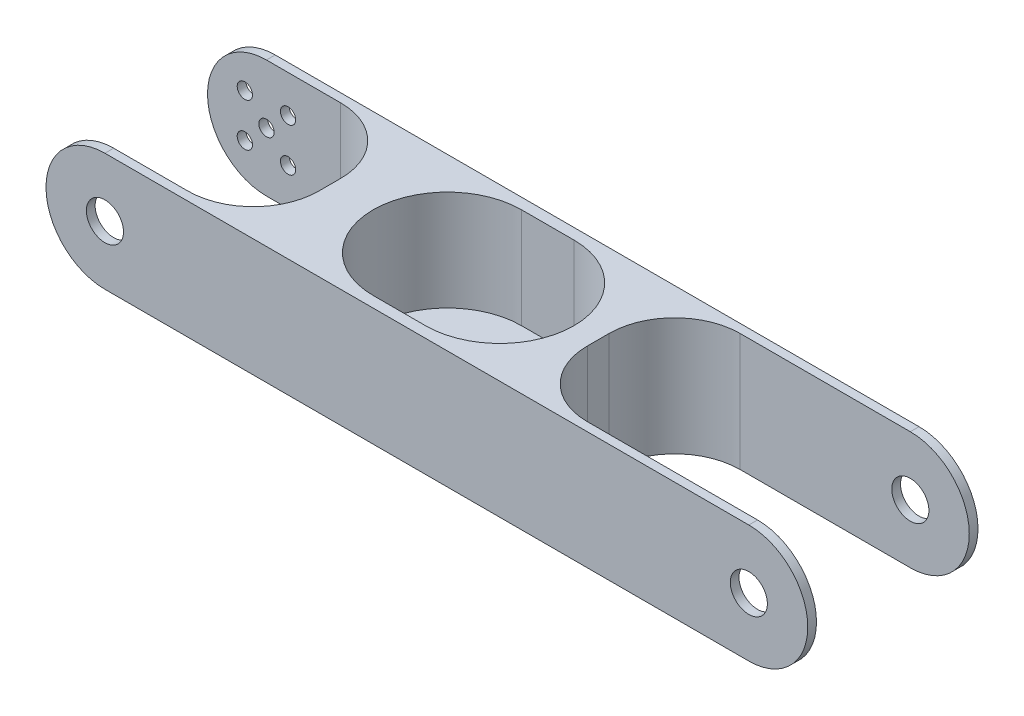
ISO-10303-21;
HEADER;
FILE_DESCRIPTION(('STEP AP214'),'2;1');
FILE_NAME('part.step','',(''),(''),'','','');
FILE_SCHEMA(('AUTOMOTIVE_DESIGN { 1 0 10303 214 1 1 1 1 }'));
ENDSEC;
DATA;
#1=APPLICATION_CONTEXT('core data for automotive mechanical design processes');
#2=APPLICATION_PROTOCOL_DEFINITION('international standard','automotive_design',2000,#1);
#3=PRODUCT_CONTEXT('',#1,'mechanical');
#4=PRODUCT('Part','Part','',(#3));
#5=PRODUCT_RELATED_PRODUCT_CATEGORY('part','',(#4));
#6=PRODUCT_DEFINITION_FORMATION('','',#4);
#7=PRODUCT_DEFINITION_CONTEXT('part definition',#1,'design');
#8=PRODUCT_DEFINITION('design','',#6,#7);
#9=PRODUCT_DEFINITION_SHAPE('','',#8);
#10=(LENGTH_UNIT() NAMED_UNIT(*) SI_UNIT(.MILLI.,.METRE.));
#11=(NAMED_UNIT(*) PLANE_ANGLE_UNIT() SI_UNIT($,.RADIAN.));
#12=(NAMED_UNIT(*) SI_UNIT($,.STERADIAN.) SOLID_ANGLE_UNIT());
#13=UNCERTAINTY_MEASURE_WITH_UNIT(LENGTH_MEASURE(1.E-05),#10,'distance_accuracy_value','');
#14=(GEOMETRIC_REPRESENTATION_CONTEXT(3) GLOBAL_UNCERTAINTY_ASSIGNED_CONTEXT((#13)) GLOBAL_UNIT_ASSIGNED_CONTEXT((#10,
#11,#12)) REPRESENTATION_CONTEXT('',''));
#15=CARTESIAN_POINT('',(0.,0.,0.));
#16=DIRECTION('',(0.,0.,1.));
#17=DIRECTION('',(1.,0.,0.));
#18=AXIS2_PLACEMENT_3D('',#15,#16,#17);
#19=CARTESIAN_POINT('',(147.5,0.,39.));
#20=DIRECTION('',(0.,0.,-1.));
#21=DIRECTION('',(-1.,0.,0.));
#22=AXIS2_PLACEMENT_3D('',#19,#20,#21);
#23=CYLINDRICAL_SURFACE('',#22,13.5);
#24=DIRECTION('',(0.,0.,-1.));
#25=VECTOR('',#24,1.);
#26=CARTESIAN_POINT('',(147.5,13.5,39.));
#27=LINE('',#26,#25);
#28=CARTESIAN_POINT('',(147.5,13.5,2.));
#29=VERTEX_POINT('',#28);
#30=CARTESIAN_POINT('',(147.5,13.5,0.));
#31=VERTEX_POINT('',#30);
#32=EDGE_CURVE('E439',#29,#31,#27,.T.);
#33=ORIENTED_EDGE('',*,*,#32,.F.);
#34=CARTESIAN_POINT('',(147.5,0.,2.));
#35=DIRECTION('',(0.,0.,-1.));
#36=DIRECTION('',(-1.,0.,0.));
#37=AXIS2_PLACEMENT_3D('',#34,#35,#36);
#38=CIRCLE('',#37,13.5);
#39=CARTESIAN_POINT('',(147.5,-13.5,2.));
#40=VERTEX_POINT('',#39);
#41=EDGE_CURVE('E337',#29,#40,#38,.T.);
#42=ORIENTED_EDGE('',*,*,#41,.T.);
#43=DIRECTION('',(0.,0.,-1.));
#44=VECTOR('',#43,1.);
#45=CARTESIAN_POINT('',(147.5,-13.5,39.));
#46=LINE('',#45,#44);
#47=CARTESIAN_POINT('',(147.5,-13.5,0.));
#48=VERTEX_POINT('',#47);
#49=EDGE_CURVE('E444',#40,#48,#46,.T.);
#50=ORIENTED_EDGE('',*,*,#49,.T.);
#51=CARTESIAN_POINT('',(147.5,0.,0.));
#52=DIRECTION('',(0.,0.,1.));
#53=DIRECTION('',(1.,0.,0.));
#54=AXIS2_PLACEMENT_3D('',#51,#52,#53);
#55=CIRCLE('',#54,13.5);
#56=EDGE_CURVE('E428',#48,#31,#55,.T.);
#57=ORIENTED_EDGE('',*,*,#56,.T.);
#58=EDGE_LOOP('',(#33,#42,#50,#57));
#59=FACE_BOUND('',#58,.T.);
#60=ADVANCED_FACE('F44',(#59),#23,.T.);
#61=CARTESIAN_POINT('',(147.5,0.,0.));
#62=DIRECTION('',(0.,0.,1.));
#63=DIRECTION('',(1.,0.,0.));
#64=AXIS2_PLACEMENT_3D('',#61,#62,#63);
#65=CYLINDRICAL_SURFACE('',#64,4.25000000000001);
#66=CARTESIAN_POINT('',(147.5,0.,2.));
#67=DIRECTION('',(0.,0.,-1.));
#68=DIRECTION('',(-1.,0.,0.));
#69=AXIS2_PLACEMENT_3D('',#66,#67,#68);
#70=CIRCLE('',#69,4.25000000000001);
#71=CARTESIAN_POINT('',(143.25,0.,2.));
#72=VERTEX_POINT('',#71);
#73=EDGE_CURVE('E336',#72,#72,#70,.F.);
#74=ORIENTED_EDGE('',*,*,#73,.T.);
#75=EDGE_LOOP('',(#74));
#76=FACE_BOUND('',#75,.T.);
#77=CARTESIAN_POINT('',(147.5,0.,0.));
#78=DIRECTION('',(0.,0.,1.));
#79=DIRECTION('',(1.,0.,0.));
#80=AXIS2_PLACEMENT_3D('',#77,#78,#79);
#81=CIRCLE('',#80,4.25000000000001);
#82=CARTESIAN_POINT('',(151.75,0.,0.));
#83=VERTEX_POINT('',#82);
#84=EDGE_CURVE('E398',#83,#83,#81,.T.);
#85=ORIENTED_EDGE('',*,*,#84,.F.);
#86=EDGE_LOOP('',(#85));
#87=FACE_BOUND('',#86,.T.);
#88=ADVANCED_FACE('F618',(#76,#87),#65,.F.);
#89=CARTESIAN_POINT('',(0.,0.,39.));
#90=DIRECTION('',(0.,0.,-1.));
#91=DIRECTION('',(-1.,0.,0.));
#92=AXIS2_PLACEMENT_3D('',#89,#90,#91);
#93=CYLINDRICAL_SURFACE('',#92,13.5);
#94=DIRECTION('',(0.,0.,-1.));
#95=VECTOR('',#94,1.);
#96=CARTESIAN_POINT('',(0.,-13.5,39.));
#97=LINE('',#96,#95);
#98=CARTESIAN_POINT('',(0.,-13.5,2.));
#99=VERTEX_POINT('',#98);
#100=CARTESIAN_POINT('',(0.,-13.5,0.));
#101=VERTEX_POINT('',#100);
#102=EDGE_CURVE('E449',#99,#101,#97,.T.);
#103=ORIENTED_EDGE('',*,*,#102,.F.);
#104=CARTESIAN_POINT('',(0.,0.,2.));
#105=DIRECTION('',(0.,0.,-1.));
#106=DIRECTION('',(-1.,0.,0.));
#107=AXIS2_PLACEMENT_3D('',#104,#105,#106);
#108=CIRCLE('',#107,13.5);
#109=CARTESIAN_POINT('',(0.,13.5,2.));
#110=VERTEX_POINT('',#109);
#111=EDGE_CURVE('E393',#99,#110,#108,.T.);
#112=ORIENTED_EDGE('',*,*,#111,.T.);
#113=DIRECTION('',(0.,0.,-1.));
#114=VECTOR('',#113,1.);
#115=CARTESIAN_POINT('',(0.,13.5,39.));
#116=LINE('',#115,#114);
#117=CARTESIAN_POINT('',(0.,13.5,0.));
#118=VERTEX_POINT('',#117);
#119=EDGE_CURVE('E420',#110,#118,#116,.T.);
#120=ORIENTED_EDGE('',*,*,#119,.T.);
#121=CARTESIAN_POINT('',(0.,0.,0.));
#122=DIRECTION('',(0.,0.,1.));
#123=DIRECTION('',(1.,0.,0.));
#124=AXIS2_PLACEMENT_3D('',#121,#122,#123);
#125=CIRCLE('',#124,13.5);
#126=EDGE_CURVE('E402',#118,#101,#125,.T.);
#127=ORIENTED_EDGE('',*,*,#126,.T.);
#128=EDGE_LOOP('',(#103,#112,#120,#127));
#129=FACE_BOUND('',#128,.T.);
#130=ADVANCED_FACE('F575',(#129),#93,.T.);
#131=CARTESIAN_POINT('',(0.,13.5,39.));
#132=VERTEX_POINT('',#131);
#133=CARTESIAN_POINT('',(0.,13.5,37.));
#134=VERTEX_POINT('',#133);
#135=EDGE_CURVE('E435',#132,#134,#116,.T.);
#136=ORIENTED_EDGE('',*,*,#135,.T.);
#137=CARTESIAN_POINT('',(0.,0.,37.));
#138=DIRECTION('',(0.,0.,1.));
#139=DIRECTION('',(1.,0.,0.));
#140=AXIS2_PLACEMENT_3D('',#137,#138,#139);
#141=CIRCLE('',#140,13.5);
#142=CARTESIAN_POINT('',(0.,-13.5,37.));
#143=VERTEX_POINT('',#142);
#144=EDGE_CURVE('E380',#134,#143,#141,.T.);
#145=ORIENTED_EDGE('',*,*,#144,.T.);
#146=CARTESIAN_POINT('',(0.,-13.5,39.));
#147=VERTEX_POINT('',#146);
#148=EDGE_CURVE('E450',#147,#143,#97,.T.);
#149=ORIENTED_EDGE('',*,*,#148,.F.);
#150=CARTESIAN_POINT('',(0.,0.,39.));
#151=DIRECTION('',(0.,0.,1.));
#152=DIRECTION('',(1.,0.,0.));
#153=AXIS2_PLACEMENT_3D('',#150,#151,#152);
#154=CIRCLE('',#153,13.5);
#155=EDGE_CURVE('E406',#132,#147,#154,.T.);
#156=ORIENTED_EDGE('',*,*,#155,.F.);
#157=EDGE_LOOP('',(#136,#145,#149,#156));
#158=FACE_BOUND('',#157,.T.);
#159=ADVANCED_FACE('F46',(#158),#93,.T.);
#160=CARTESIAN_POINT('',(0.,-13.5,39.));
#161=DIRECTION('',(0.,1.,0.));
#162=DIRECTION('',(0.,0.,1.));
#163=AXIS2_PLACEMENT_3D('',#160,#161,#162);
#164=PLANE('',#163);
#165=DIRECTION('',(1.,0.,0.));
#166=VECTOR('',#165,1.);
#167=CARTESIAN_POINT('',(62.,-13.5,10.));
#168=LINE('',#167,#166);
#169=CARTESIAN_POINT('',(62.,-13.5,10.));
#170=VERTEX_POINT('',#169);
#171=CARTESIAN_POINT('',(70.,-13.5,10.));
#172=VERTEX_POINT('',#171);
#173=EDGE_CURVE('E218',#170,#172,#168,.T.);
#174=ORIENTED_EDGE('',*,*,#173,.F.);
#175=CARTESIAN_POINT('',(62.,-13.5,19.5));
#176=DIRECTION('',(0.,-1.,0.));
#177=DIRECTION('',(0.,0.,-1.));
#178=AXIS2_PLACEMENT_3D('',#175,#176,#177);
#179=CIRCLE('',#178,9.49999999999999);
#180=CARTESIAN_POINT('',(62.,-13.5,29.));
#181=VERTEX_POINT('',#180);
#182=EDGE_CURVE('E60',#181,#170,#179,.T.);
#183=ORIENTED_EDGE('',*,*,#182,.F.);
#184=DIRECTION('',(-1.,0.,0.));
#185=VECTOR('',#184,1.);
#186=CARTESIAN_POINT('',(62.,-13.5,29.));
#187=LINE('',#186,#185);
#188=CARTESIAN_POINT('',(70.,-13.5,29.));
#189=VERTEX_POINT('',#188);
#190=EDGE_CURVE('E226',#189,#181,#187,.T.);
#191=ORIENTED_EDGE('',*,*,#190,.F.);
#192=CARTESIAN_POINT('',(70.,-13.5,19.5));
#193=DIRECTION('',(0.,-1.,0.));
#194=DIRECTION('',(0.,0.,-1.));
#195=AXIS2_PLACEMENT_3D('',#192,#193,#194);
#196=CIRCLE('',#195,9.49999999999999);
#197=EDGE_CURVE('E208',#172,#189,#196,.T.);
#198=ORIENTED_EDGE('',*,*,#197,.F.);
#199=EDGE_LOOP('',(#174,#183,#191,#198));
#200=FACE_BOUND('',#199,.T.);
#201=ORIENTED_EDGE('',*,*,#49,.F.);
#202=DIRECTION('',(1.,0.,0.));
#203=VECTOR('',#202,1.);
#204=CARTESIAN_POINT('',(108.5,-13.5,2.));
#205=LINE('',#204,#203);
#206=CARTESIAN_POINT('',(108.5,-13.5,2.));
#207=VERTEX_POINT('',#206);
#208=EDGE_CURVE('E286',#207,#40,#205,.T.);
#209=ORIENTED_EDGE('',*,*,#208,.F.);
#210=CARTESIAN_POINT('',(108.5,-13.5,17.));
#211=DIRECTION('',(0.,-1.,0.));
#212=DIRECTION('',(0.,0.,1.));
#213=AXIS2_PLACEMENT_3D('',#210,#211,#212);
#214=CIRCLE('',#213,15.);
#215=CARTESIAN_POINT('',(93.5,-13.5,17.));
#216=VERTEX_POINT('',#215);
#217=EDGE_CURVE('E313',#216,#207,#214,.T.);
#218=ORIENTED_EDGE('',*,*,#217,.F.);
#219=DIRECTION('',(0.,0.,-1.));
#220=VECTOR('',#219,1.);
#221=CARTESIAN_POINT('',(93.5,-13.5,22.));
#222=LINE('',#221,#220);
#223=CARTESIAN_POINT('',(93.5,-13.5,22.));
#224=VERTEX_POINT('',#223);
#225=EDGE_CURVE('E309',#224,#216,#222,.T.);
#226=ORIENTED_EDGE('',*,*,#225,.F.);
#227=CARTESIAN_POINT('',(108.5,-13.5,22.));
#228=DIRECTION('',(0.,-1.,0.));
#229=DIRECTION('',(0.,0.,-1.));
#230=AXIS2_PLACEMENT_3D('',#227,#228,#229);
#231=CIRCLE('',#230,15.);
#232=CARTESIAN_POINT('',(108.5,-13.5,37.));
#233=VERTEX_POINT('',#232);
#234=EDGE_CURVE('E305',#233,#224,#231,.T.);
#235=ORIENTED_EDGE('',*,*,#234,.F.);
#236=DIRECTION('',(-1.,0.,0.));
#237=VECTOR('',#236,1.);
#238=CARTESIAN_POINT('',(108.5,-13.5,37.));
#239=LINE('',#238,#237);
#240=CARTESIAN_POINT('',(147.5,-13.5,37.));
#241=VERTEX_POINT('',#240);
#242=EDGE_CURVE('E280',#241,#233,#239,.T.);
#243=ORIENTED_EDGE('',*,*,#242,.F.);
#244=CARTESIAN_POINT('',(147.5,-13.5,39.));
#245=VERTEX_POINT('',#244);
#246=EDGE_CURVE('E445',#245,#241,#46,.T.);
#247=ORIENTED_EDGE('',*,*,#246,.F.);
#248=DIRECTION('',(1.,0.,0.));
#249=VECTOR('',#248,1.);
#250=CARTESIAN_POINT('',(0.,-13.5,39.));
#251=LINE('',#250,#249);
#252=EDGE_CURVE('E410',#147,#245,#251,.T.);
#253=ORIENTED_EDGE('',*,*,#252,.F.);
#254=ORIENTED_EDGE('',*,*,#148,.T.);
#255=DIRECTION('',(1.,0.,0.));
#256=VECTOR('',#255,1.);
#257=CARTESIAN_POINT('',(-32.,-13.5,37.));
#258=LINE('',#257,#256);
#259=CARTESIAN_POINT('',(17.,-13.5,37.));
#260=VERTEX_POINT('',#259);
#261=EDGE_CURVE('E342',#143,#260,#258,.T.);
#262=ORIENTED_EDGE('',*,*,#261,.T.);
#263=CARTESIAN_POINT('',(17.,-13.5,22.));
#264=DIRECTION('',(0.,1.,0.));
#265=DIRECTION('',(0.,0.,-1.));
#266=AXIS2_PLACEMENT_3D('',#263,#264,#265);
#267=CIRCLE('',#266,15.);
#268=CARTESIAN_POINT('',(32.,-13.5,22.));
#269=VERTEX_POINT('',#268);
#270=EDGE_CURVE('E346',#260,#269,#267,.T.);
#271=ORIENTED_EDGE('',*,*,#270,.T.);
#272=DIRECTION('',(0.,0.,-1.));
#273=VECTOR('',#272,1.);
#274=CARTESIAN_POINT('',(32.,-13.5,22.));
#275=LINE('',#274,#273);
#276=CARTESIAN_POINT('',(32.,-13.5,17.));
#277=VERTEX_POINT('',#276);
#278=EDGE_CURVE('E351',#269,#277,#275,.T.);
#279=ORIENTED_EDGE('',*,*,#278,.T.);
#280=CARTESIAN_POINT('',(17.,-13.5,17.));
#281=DIRECTION('',(0.,1.,0.));
#282=DIRECTION('',(0.,0.,-1.));
#283=AXIS2_PLACEMENT_3D('',#280,#281,#282);
#284=CIRCLE('',#283,15.);
#285=CARTESIAN_POINT('',(17.,-13.5,2.));
#286=VERTEX_POINT('',#285);
#287=EDGE_CURVE('E355',#277,#286,#284,.T.);
#288=ORIENTED_EDGE('',*,*,#287,.T.);
#289=DIRECTION('',(-1.,0.,0.));
#290=VECTOR('',#289,1.);
#291=CARTESIAN_POINT('',(-32.,-13.5,2.));
#292=LINE('',#291,#290);
#293=EDGE_CURVE('E359',#286,#99,#292,.T.);
#294=ORIENTED_EDGE('',*,*,#293,.T.);
#295=ORIENTED_EDGE('',*,*,#102,.T.);
#296=DIRECTION('',(1.,0.,0.));
#297=VECTOR('',#296,1.);
#298=CARTESIAN_POINT('',(0.,-13.5,0.));
#299=LINE('',#298,#297);
#300=EDGE_CURVE('E424',#101,#48,#299,.T.);
#301=ORIENTED_EDGE('',*,*,#300,.T.);
#302=EDGE_LOOP('',(#201,#209,#218,#226,#235,#243,#247,#253,#254,#262,#271,#279,#288,#294,#295,#301));
#303=FACE_BOUND('',#302,.T.);
#304=ADVANCED_FACE('F223',(#200,#303),#164,.F.);
#305=ORIENTED_EDGE('',*,*,#246,.T.);
#306=CARTESIAN_POINT('',(147.5,0.,37.));
#307=DIRECTION('',(0.,0.,1.));
#308=DIRECTION('',(1.,0.,0.));
#309=AXIS2_PLACEMENT_3D('',#306,#307,#308);
#310=CIRCLE('',#309,13.5);
#311=CARTESIAN_POINT('',(147.5,13.5,37.));
#312=VERTEX_POINT('',#311);
#313=EDGE_CURVE('E332',#241,#312,#310,.T.);
#314=ORIENTED_EDGE('',*,*,#313,.T.);
#315=CARTESIAN_POINT('',(147.5,13.5,39.));
#316=VERTEX_POINT('',#315);
#317=EDGE_CURVE('E440',#316,#312,#27,.T.);
#318=ORIENTED_EDGE('',*,*,#317,.F.);
#319=CARTESIAN_POINT('',(147.5,0.,39.));
#320=DIRECTION('',(0.,0.,1.));
#321=DIRECTION('',(1.,0.,0.));
#322=AXIS2_PLACEMENT_3D('',#319,#320,#321);
#323=CIRCLE('',#322,13.5);
#324=EDGE_CURVE('E414',#245,#316,#323,.T.);
#325=ORIENTED_EDGE('',*,*,#324,.F.);
#326=EDGE_LOOP('',(#305,#314,#318,#325));
#327=FACE_BOUND('',#326,.T.);
#328=ADVANCED_FACE('F552',(#327),#23,.T.);
#329=CARTESIAN_POINT('',(0.,13.5,39.));
#330=DIRECTION('',(0.,-1.,0.));
#331=DIRECTION('',(0.,0.,-1.));
#332=AXIS2_PLACEMENT_3D('',#329,#330,#331);
#333=PLANE('',#332);
#334=DIRECTION('',(1.,0.,0.));
#335=VECTOR('',#334,1.);
#336=CARTESIAN_POINT('',(58.9447918531487,13.5,36.5));
#337=LINE('',#336,#335);
#338=CARTESIAN_POINT('',(58.9447918531487,13.5,36.5));
#339=VERTEX_POINT('',#338);
#340=CARTESIAN_POINT('',(70.9447918531488,13.5,36.5));
#341=VERTEX_POINT('',#340);
#342=EDGE_CURVE('E254',#339,#341,#337,.T.);
#343=ORIENTED_EDGE('',*,*,#342,.F.);
#344=CARTESIAN_POINT('',(58.9447918531487,13.5,19.5));
#345=DIRECTION('',(0.,1.,0.));
#346=DIRECTION('',(0.,0.,1.));
#347=AXIS2_PLACEMENT_3D('',#344,#345,#346);
#348=CIRCLE('',#347,17.);
#349=CARTESIAN_POINT('',(58.9447918531487,13.5,2.5));
#350=VERTEX_POINT('',#349);
#351=EDGE_CURVE('E236',#350,#339,#348,.T.);
#352=ORIENTED_EDGE('',*,*,#351,.F.);
#353=DIRECTION('',(-1.,0.,0.));
#354=VECTOR('',#353,1.);
#355=CARTESIAN_POINT('',(58.9447918531487,13.5,2.5));
#356=LINE('',#355,#354);
#357=CARTESIAN_POINT('',(70.9447918531487,13.5,2.5));
#358=VERTEX_POINT('',#357);
#359=EDGE_CURVE('E262',#358,#350,#356,.T.);
#360=ORIENTED_EDGE('',*,*,#359,.F.);
#361=CARTESIAN_POINT('',(70.9447918531487,13.5,19.5));
#362=DIRECTION('',(0.,1.,0.));
#363=DIRECTION('',(0.,0.,1.));
#364=AXIS2_PLACEMENT_3D('',#361,#362,#363);
#365=CIRCLE('',#364,17.);
#366=EDGE_CURVE('E258',#341,#358,#365,.T.);
#367=ORIENTED_EDGE('',*,*,#366,.F.);
#368=EDGE_LOOP('',(#343,#352,#360,#367));
#369=FACE_BOUND('',#368,.T.);
#370=CARTESIAN_POINT('',(108.5,13.5,17.));
#371=DIRECTION('',(0.,-1.,0.));
#372=DIRECTION('',(0.,0.,1.));
#373=AXIS2_PLACEMENT_3D('',#370,#371,#372);
#374=CIRCLE('',#373,15.);
#375=CARTESIAN_POINT('',(93.5,13.5,17.));
#376=VERTEX_POINT('',#375);
#377=CARTESIAN_POINT('',(108.5,13.5,2.));
#378=VERTEX_POINT('',#377);
#379=EDGE_CURVE('E294',#376,#378,#374,.T.);
#380=ORIENTED_EDGE('',*,*,#379,.T.);
#381=DIRECTION('',(1.,0.,0.));
#382=VECTOR('',#381,1.);
#383=CARTESIAN_POINT('',(108.5,13.5,2.));
#384=LINE('',#383,#382);
#385=EDGE_CURVE('E298',#378,#29,#384,.T.);
#386=ORIENTED_EDGE('',*,*,#385,.T.);
#387=ORIENTED_EDGE('',*,*,#32,.T.);
#388=DIRECTION('',(-1.,0.,0.));
#389=VECTOR('',#388,1.);
#390=CARTESIAN_POINT('',(0.,13.5,0.));
#391=LINE('',#390,#389);
#392=EDGE_CURVE('E411',#31,#118,#391,.T.);
#393=ORIENTED_EDGE('',*,*,#392,.T.);
#394=ORIENTED_EDGE('',*,*,#119,.F.);
#395=DIRECTION('',(-1.,0.,0.));
#396=VECTOR('',#395,1.);
#397=CARTESIAN_POINT('',(-32.,13.5,2.));
#398=LINE('',#397,#396);
#399=CARTESIAN_POINT('',(17.,13.5,2.));
#400=VERTEX_POINT('',#399);
#401=EDGE_CURVE('E347',#400,#110,#398,.T.);
#402=ORIENTED_EDGE('',*,*,#401,.F.);
#403=CARTESIAN_POINT('',(17.,13.5,17.));
#404=DIRECTION('',(0.,1.,0.));
#405=DIRECTION('',(0.,0.,-1.));
#406=AXIS2_PLACEMENT_3D('',#403,#404,#405);
#407=CIRCLE('',#406,15.);
#408=CARTESIAN_POINT('',(32.,13.5,17.));
#409=VERTEX_POINT('',#408);
#410=EDGE_CURVE('E371',#409,#400,#407,.T.);
#411=ORIENTED_EDGE('',*,*,#410,.F.);
#412=DIRECTION('',(0.,0.,-1.));
#413=VECTOR('',#412,1.);
#414=CARTESIAN_POINT('',(32.,13.5,22.));
#415=LINE('',#414,#413);
#416=CARTESIAN_POINT('',(32.,13.5,22.));
#417=VERTEX_POINT('',#416);
#418=EDGE_CURVE('E367',#417,#409,#415,.T.);
#419=ORIENTED_EDGE('',*,*,#418,.F.);
#420=CARTESIAN_POINT('',(17.,13.5,22.));
#421=DIRECTION('',(0.,1.,0.));
#422=DIRECTION('',(0.,0.,-1.));
#423=AXIS2_PLACEMENT_3D('',#420,#421,#422);
#424=CIRCLE('',#423,15.);
#425=CARTESIAN_POINT('',(17.,13.5,37.));
#426=VERTEX_POINT('',#425);
#427=EDGE_CURVE('E341',#426,#417,#424,.T.);
#428=ORIENTED_EDGE('',*,*,#427,.F.);
#429=DIRECTION('',(-1.,0.,0.));
#430=VECTOR('',#429,1.);
#431=CARTESIAN_POINT('',(0.,13.5,37.));
#432=LINE('',#431,#430);
#433=EDGE_CURVE('E454',#426,#134,#432,.T.);
#434=ORIENTED_EDGE('',*,*,#433,.T.);
#435=ORIENTED_EDGE('',*,*,#135,.F.);
#436=DIRECTION('',(-1.,0.,0.));
#437=VECTOR('',#436,1.);
#438=CARTESIAN_POINT('',(0.,13.5,39.));
#439=LINE('',#438,#437);
#440=EDGE_CURVE('E417',#316,#132,#439,.T.);
#441=ORIENTED_EDGE('',*,*,#440,.F.);
#442=ORIENTED_EDGE('',*,*,#317,.T.);
#443=DIRECTION('',(-1.,0.,0.));
#444=VECTOR('',#443,1.);
#445=CARTESIAN_POINT('',(108.5,13.5,37.));
#446=LINE('',#445,#444);
#447=CARTESIAN_POINT('',(108.5,13.5,37.));
#448=VERTEX_POINT('',#447);
#449=EDGE_CURVE('E281',#312,#448,#446,.T.);
#450=ORIENTED_EDGE('',*,*,#449,.T.);
#451=CARTESIAN_POINT('',(108.5,13.5,22.));
#452=DIRECTION('',(0.,-1.,0.));
#453=DIRECTION('',(0.,0.,-1.));
#454=AXIS2_PLACEMENT_3D('',#451,#452,#453);
#455=CIRCLE('',#454,15.);
#456=CARTESIAN_POINT('',(93.5,13.5,22.));
#457=VERTEX_POINT('',#456);
#458=EDGE_CURVE('E285',#448,#457,#455,.T.);
#459=ORIENTED_EDGE('',*,*,#458,.T.);
#460=DIRECTION('',(0.,0.,-1.));
#461=VECTOR('',#460,1.);
#462=CARTESIAN_POINT('',(93.5,13.5,22.));
#463=LINE('',#462,#461);
#464=EDGE_CURVE('E290',#457,#376,#463,.T.);
#465=ORIENTED_EDGE('',*,*,#464,.T.);
#466=EDGE_LOOP('',(#380,#386,#387,#393,#394,#402,#411,#419,#428,#434,#435,#441,#442,#450,#459,#465));
#467=FACE_BOUND('',#466,.T.);
#468=ADVANCED_FACE('F536',(#369,#467),#333,.F.);
#469=CARTESIAN_POINT('',(0.,0.,39.));
#470=DIRECTION('',(0.,0.,1.));
#471=DIRECTION('',(1.,0.,0.));
#472=AXIS2_PLACEMENT_3D('',#469,#470,#471);
#473=PLANE('',#472);
#474=CARTESIAN_POINT('',(0.,0.,39.));
#475=DIRECTION('',(0.,0.,1.));
#476=DIRECTION('',(1.,0.,0.));
#477=AXIS2_PLACEMENT_3D('',#474,#475,#476);
#478=CIRCLE('',#477,4.25);
#479=CARTESIAN_POINT('',(4.25,0.,39.));
#480=VERTEX_POINT('',#479);
#481=EDGE_CURVE('E524',#480,#480,#478,.T.);
#482=ORIENTED_EDGE('',*,*,#481,.F.);
#483=EDGE_LOOP('',(#482));
#484=FACE_BOUND('',#483,.T.);
#485=CARTESIAN_POINT('',(147.5,0.,39.));
#486=DIRECTION('',(0.,0.,1.));
#487=DIRECTION('',(1.,0.,0.));
#488=AXIS2_PLACEMENT_3D('',#485,#486,#487);
#489=CIRCLE('',#488,4.25000000000001);
#490=CARTESIAN_POINT('',(151.75,0.,39.));
#491=VERTEX_POINT('',#490);
#492=EDGE_CURVE('E397',#491,#491,#489,.T.);
#493=ORIENTED_EDGE('',*,*,#492,.F.);
#494=EDGE_LOOP('',(#493));
#495=FACE_BOUND('',#494,.T.);
#496=ORIENTED_EDGE('',*,*,#155,.T.);
#497=ORIENTED_EDGE('',*,*,#252,.T.);
#498=ORIENTED_EDGE('',*,*,#324,.T.);
#499=ORIENTED_EDGE('',*,*,#440,.T.);
#500=EDGE_LOOP('',(#496,#497,#498,#499));
#501=FACE_BOUND('',#500,.T.);
#502=ADVANCED_FACE('F532',(#484,#495,#501),#473,.T.);
#503=CARTESIAN_POINT('',(0.,0.,0.));
#504=DIRECTION('',(0.,0.,1.));
#505=DIRECTION('',(1.,0.,0.));
#506=AXIS2_PLACEMENT_3D('',#503,#504,#505);
#507=PLANE('',#506);
#508=CARTESIAN_POINT('',(-4.94974746830583,4.94974746830583,0.));
#509=DIRECTION('',(0.,0.,-1.));
#510=DIRECTION('',(-1.,0.,0.));
#511=AXIS2_PLACEMENT_3D('',#508,#509,#510);
#512=CIRCLE('',#511,1.75);
#513=CARTESIAN_POINT('',(-6.69974746830583,4.94974746830583,0.));
#514=VERTEX_POINT('',#513);
#515=EDGE_CURVE('E493',#514,#514,#512,.T.);
#516=ORIENTED_EDGE('',*,*,#515,.F.);
#517=EDGE_LOOP('',(#516));
#518=FACE_BOUND('',#517,.T.);
#519=CARTESIAN_POINT('',(4.94974746830587,-4.9497474683058,0.));
#520=DIRECTION('',(0.,0.,-1.));
#521=DIRECTION('',(-1.,0.,0.));
#522=AXIS2_PLACEMENT_3D('',#519,#520,#521);
#523=CIRCLE('',#522,1.75);
#524=CARTESIAN_POINT('',(3.19974746830587,-4.9497474683058,0.));
#525=VERTEX_POINT('',#524);
#526=EDGE_CURVE('E494',#525,#525,#523,.T.);
#527=ORIENTED_EDGE('',*,*,#526,.F.);
#528=EDGE_LOOP('',(#527));
#529=FACE_BOUND('',#528,.T.);
#530=CARTESIAN_POINT('',(-4.94974746830582,-4.94974746830585,0.));
#531=DIRECTION('',(0.,0.,-1.));
#532=DIRECTION('',(-1.,0.,0.));
#533=AXIS2_PLACEMENT_3D('',#530,#531,#532);
#534=CIRCLE('',#533,1.75);
#535=CARTESIAN_POINT('',(-6.69974746830582,-4.94974746830585,0.));
#536=VERTEX_POINT('',#535);
#537=EDGE_CURVE('E509',#536,#536,#534,.T.);
#538=ORIENTED_EDGE('',*,*,#537,.F.);
#539=EDGE_LOOP('',(#538));
#540=FACE_BOUND('',#539,.T.);
#541=CARTESIAN_POINT('',(0.,0.,0.));
#542=DIRECTION('',(0.,0.,-1.));
#543=DIRECTION('',(-1.,0.,0.));
#544=AXIS2_PLACEMENT_3D('',#541,#542,#543);
#545=CIRCLE('',#544,1.75);
#546=CARTESIAN_POINT('',(-1.75,0.,0.));
#547=VERTEX_POINT('',#546);
#548=EDGE_CURVE('E510',#547,#547,#545,.T.);
#549=ORIENTED_EDGE('',*,*,#548,.F.);
#550=EDGE_LOOP('',(#549));
#551=FACE_BOUND('',#550,.T.);
#552=CARTESIAN_POINT('',(4.94974746830578,4.94974746830588,0.));
#553=DIRECTION('',(0.,0.,-1.));
#554=DIRECTION('',(-1.,0.,0.));
#555=AXIS2_PLACEMENT_3D('',#552,#553,#554);
#556=CIRCLE('',#555,1.75);
#557=CARTESIAN_POINT('',(3.19974746830578,4.94974746830588,0.));
#558=VERTEX_POINT('',#557);
#559=EDGE_CURVE('E482',#558,#558,#556,.T.);
#560=ORIENTED_EDGE('',*,*,#559,.F.);
#561=EDGE_LOOP('',(#560));
#562=FACE_BOUND('',#561,.T.);
#563=ORIENTED_EDGE('',*,*,#84,.T.);
#564=EDGE_LOOP('',(#563));
#565=FACE_BOUND('',#564,.T.);
#566=ORIENTED_EDGE('',*,*,#126,.F.);
#567=ORIENTED_EDGE('',*,*,#392,.F.);
#568=ORIENTED_EDGE('',*,*,#56,.F.);
#569=ORIENTED_EDGE('',*,*,#300,.F.);
#570=EDGE_LOOP('',(#566,#567,#568,#569));
#571=FACE_BOUND('',#570,.T.);
#572=ADVANCED_FACE('F535',(#518,#529,#540,#551,#562,#565,#571),#507,.F.);
#573=CARTESIAN_POINT('',(147.5,0.,37.));
#574=DIRECTION('',(0.,0.,1.));
#575=DIRECTION('',(1.,0.,0.));
#576=AXIS2_PLACEMENT_3D('',#573,#574,#575);
#577=CIRCLE('',#576,4.25000000000001);
#578=CARTESIAN_POINT('',(151.75,0.,37.));
#579=VERTEX_POINT('',#578);
#580=EDGE_CURVE('E322',#579,#579,#577,.F.);
#581=ORIENTED_EDGE('',*,*,#580,.T.);
#582=EDGE_LOOP('',(#581));
#583=FACE_BOUND('',#582,.T.);
#584=ORIENTED_EDGE('',*,*,#492,.T.);
#585=EDGE_LOOP('',(#584));
#586=FACE_BOUND('',#585,.T.);
#587=ADVANCED_FACE('F625',(#583,#586),#65,.F.);
#588=CARTESIAN_POINT('',(-32.,-13.5,2.));
#589=DIRECTION('',(0.,0.,-1.));
#590=DIRECTION('',(-1.,0.,0.));
#591=AXIS2_PLACEMENT_3D('',#588,#589,#590);
#592=PLANE('',#591);
#593=CARTESIAN_POINT('',(-4.94974746830583,4.94974746830583,2.));
#594=DIRECTION('',(0.,0.,-1.));
#595=DIRECTION('',(-1.,0.,0.));
#596=AXIS2_PLACEMENT_3D('',#593,#594,#595);
#597=CIRCLE('',#596,1.75);
#598=CARTESIAN_POINT('',(-6.69974746830583,4.94974746830583,2.));
#599=VERTEX_POINT('',#598);
#600=EDGE_CURVE('E488',#599,#599,#597,.F.);
#601=ORIENTED_EDGE('',*,*,#600,.F.);
#602=EDGE_LOOP('',(#601));
#603=FACE_BOUND('',#602,.T.);
#604=CARTESIAN_POINT('',(4.94974746830587,-4.9497474683058,2.));
#605=DIRECTION('',(0.,0.,-1.));
#606=DIRECTION('',(-1.,0.,0.));
#607=AXIS2_PLACEMENT_3D('',#604,#605,#606);
#608=CIRCLE('',#607,1.75);
#609=CARTESIAN_POINT('',(3.19974746830587,-4.9497474683058,2.));
#610=VERTEX_POINT('',#609);
#611=EDGE_CURVE('E489',#610,#610,#608,.F.);
#612=ORIENTED_EDGE('',*,*,#611,.F.);
#613=EDGE_LOOP('',(#612));
#614=FACE_BOUND('',#613,.T.);
#615=CARTESIAN_POINT('',(-4.94974746830582,-4.94974746830585,2.));
#616=DIRECTION('',(0.,0.,-1.));
#617=DIRECTION('',(-1.,0.,0.));
#618=AXIS2_PLACEMENT_3D('',#615,#616,#617);
#619=CIRCLE('',#618,1.75);
#620=CARTESIAN_POINT('',(-6.69974746830582,-4.94974746830585,2.));
#621=VERTEX_POINT('',#620);
#622=EDGE_CURVE('E498',#621,#621,#619,.F.);
#623=ORIENTED_EDGE('',*,*,#622,.F.);
#624=EDGE_LOOP('',(#623));
#625=FACE_BOUND('',#624,.T.);
#626=CARTESIAN_POINT('',(0.,0.,2.));
#627=DIRECTION('',(0.,0.,-1.));
#628=DIRECTION('',(-1.,0.,0.));
#629=AXIS2_PLACEMENT_3D('',#626,#627,#628);
#630=CIRCLE('',#629,1.75);
#631=CARTESIAN_POINT('',(-1.75,0.,2.));
#632=VERTEX_POINT('',#631);
#633=EDGE_CURVE('E505',#632,#632,#630,.F.);
#634=ORIENTED_EDGE('',*,*,#633,.F.);
#635=EDGE_LOOP('',(#634));
#636=FACE_BOUND('',#635,.T.);
#637=CARTESIAN_POINT('',(4.94974746830578,4.94974746830588,2.));
#638=DIRECTION('',(0.,0.,-1.));
#639=DIRECTION('',(-1.,0.,0.));
#640=AXIS2_PLACEMENT_3D('',#637,#638,#639);
#641=CIRCLE('',#640,1.75);
#642=CARTESIAN_POINT('',(3.19974746830578,4.94974746830588,2.));
#643=VERTEX_POINT('',#642);
#644=EDGE_CURVE('E479',#643,#643,#641,.F.);
#645=ORIENTED_EDGE('',*,*,#644,.F.);
#646=EDGE_LOOP('',(#645));
#647=FACE_BOUND('',#646,.T.);
#648=ORIENTED_EDGE('',*,*,#293,.F.);
#649=DIRECTION('',(0.,1.,0.));
#650=VECTOR('',#649,1.);
#651=CARTESIAN_POINT('',(17.,-13.5,2.));
#652=LINE('',#651,#650);
#653=EDGE_CURVE('E377',#286,#400,#652,.T.);
#654=ORIENTED_EDGE('',*,*,#653,.T.);
#655=ORIENTED_EDGE('',*,*,#401,.T.);
#656=ORIENTED_EDGE('',*,*,#111,.F.);
#657=EDGE_LOOP('',(#648,#654,#655,#656));
#658=FACE_BOUND('',#657,.T.);
#659=ADVANCED_FACE('F571',(#603,#614,#625,#636,#647,#658),#592,.F.);
#660=CARTESIAN_POINT('',(-32.,-13.5,37.));
#661=DIRECTION('',(0.,0.,1.));
#662=DIRECTION('',(1.,0.,0.));
#663=AXIS2_PLACEMENT_3D('',#660,#661,#662);
#664=PLANE('',#663);
#665=CARTESIAN_POINT('',(0.,0.,37.));
#666=DIRECTION('',(0.,0.,1.));
#667=DIRECTION('',(1.,0.,0.));
#668=AXIS2_PLACEMENT_3D('',#665,#666,#667);
#669=CIRCLE('',#668,4.25);
#670=CARTESIAN_POINT('',(4.25,0.,37.));
#671=VERTEX_POINT('',#670);
#672=EDGE_CURVE('E514',#671,#671,#669,.F.);
#673=ORIENTED_EDGE('',*,*,#672,.F.);
#674=EDGE_LOOP('',(#673));
#675=FACE_BOUND('',#674,.T.);
#676=ORIENTED_EDGE('',*,*,#433,.F.);
#677=DIRECTION('',(0.,1.,0.));
#678=VECTOR('',#677,1.);
#679=CARTESIAN_POINT('',(17.,-13.5,37.));
#680=LINE('',#679,#678);
#681=EDGE_CURVE('E363',#260,#426,#680,.T.);
#682=ORIENTED_EDGE('',*,*,#681,.F.);
#683=ORIENTED_EDGE('',*,*,#261,.F.);
#684=ORIENTED_EDGE('',*,*,#144,.F.);
#685=EDGE_LOOP('',(#676,#682,#683,#684));
#686=FACE_BOUND('',#685,.T.);
#687=ADVANCED_FACE('F557',(#675,#686),#664,.F.);
#688=CARTESIAN_POINT('',(17.,-13.5,17.));
#689=DIRECTION('',(0.,1.,0.));
#690=DIRECTION('',(0.,0.,1.));
#691=AXIS2_PLACEMENT_3D('',#688,#689,#690);
#692=CYLINDRICAL_SURFACE('',#691,15.);
#693=ORIENTED_EDGE('',*,*,#410,.T.);
#694=ORIENTED_EDGE('',*,*,#653,.F.);
#695=ORIENTED_EDGE('',*,*,#287,.F.);
#696=DIRECTION('',(0.,1.,0.));
#697=VECTOR('',#696,1.);
#698=CARTESIAN_POINT('',(32.,-13.5,17.));
#699=LINE('',#698,#697);
#700=EDGE_CURVE('E381',#277,#409,#699,.T.);
#701=ORIENTED_EDGE('',*,*,#700,.T.);
#702=EDGE_LOOP('',(#693,#694,#695,#701));
#703=FACE_BOUND('',#702,.T.);
#704=ADVANCED_FACE('F567',(#703),#692,.F.);
#705=CARTESIAN_POINT('',(32.,-13.5,22.));
#706=DIRECTION('',(1.,0.,0.));
#707=DIRECTION('',(0.,0.,-1.));
#708=AXIS2_PLACEMENT_3D('',#705,#706,#707);
#709=PLANE('',#708);
#710=ORIENTED_EDGE('',*,*,#418,.T.);
#711=ORIENTED_EDGE('',*,*,#700,.F.);
#712=ORIENTED_EDGE('',*,*,#278,.F.);
#713=DIRECTION('',(0.,1.,0.));
#714=VECTOR('',#713,1.);
#715=CARTESIAN_POINT('',(32.,-13.5,22.));
#716=LINE('',#715,#714);
#717=EDGE_CURVE('E384',#269,#417,#716,.T.);
#718=ORIENTED_EDGE('',*,*,#717,.T.);
#719=EDGE_LOOP('',(#710,#711,#712,#718));
#720=FACE_BOUND('',#719,.T.);
#721=ADVANCED_FACE('F564',(#720),#709,.F.);
#722=CARTESIAN_POINT('',(17.,-13.5,22.));
#723=DIRECTION('',(0.,1.,0.));
#724=DIRECTION('',(0.,0.,1.));
#725=AXIS2_PLACEMENT_3D('',#722,#723,#724);
#726=CYLINDRICAL_SURFACE('',#725,15.);
#727=ORIENTED_EDGE('',*,*,#427,.T.);
#728=ORIENTED_EDGE('',*,*,#717,.F.);
#729=ORIENTED_EDGE('',*,*,#270,.F.);
#730=ORIENTED_EDGE('',*,*,#681,.T.);
#731=EDGE_LOOP('',(#727,#728,#729,#730));
#732=FACE_BOUND('',#731,.T.);
#733=ADVANCED_FACE('F560',(#732),#726,.F.);
#734=CARTESIAN_POINT('',(108.5,13.5,2.));
#735=DIRECTION('',(0.,0.,-1.));
#736=DIRECTION('',(-1.,0.,0.));
#737=AXIS2_PLACEMENT_3D('',#734,#735,#736);
#738=PLANE('',#737);
#739=ORIENTED_EDGE('',*,*,#73,.F.);
#740=EDGE_LOOP('',(#739));
#741=FACE_BOUND('',#740,.T.);
#742=ORIENTED_EDGE('',*,*,#385,.F.);
#743=DIRECTION('',(0.,-1.,0.));
#744=VECTOR('',#743,1.);
#745=CARTESIAN_POINT('',(108.5,13.5,2.));
#746=LINE('',#745,#744);
#747=EDGE_CURVE('E319',#378,#207,#746,.T.);
#748=ORIENTED_EDGE('',*,*,#747,.T.);
#749=ORIENTED_EDGE('',*,*,#208,.T.);
#750=ORIENTED_EDGE('',*,*,#41,.F.);
#751=EDGE_LOOP('',(#742,#748,#749,#750));
#752=FACE_BOUND('',#751,.T.);
#753=ADVANCED_FACE('F591',(#741,#752),#738,.F.);
#754=CARTESIAN_POINT('',(108.5,13.5,37.));
#755=DIRECTION('',(0.,0.,1.));
#756=DIRECTION('',(1.,0.,0.));
#757=AXIS2_PLACEMENT_3D('',#754,#755,#756);
#758=PLANE('',#757);
#759=ORIENTED_EDGE('',*,*,#580,.F.);
#760=EDGE_LOOP('',(#759));
#761=FACE_BOUND('',#760,.T.);
#762=ORIENTED_EDGE('',*,*,#242,.T.);
#763=DIRECTION('',(0.,-1.,0.));
#764=VECTOR('',#763,1.);
#765=CARTESIAN_POINT('',(108.5,13.5,37.));
#766=LINE('',#765,#764);
#767=EDGE_CURVE('E302',#448,#233,#766,.T.);
#768=ORIENTED_EDGE('',*,*,#767,.F.);
#769=ORIENTED_EDGE('',*,*,#449,.F.);
#770=ORIENTED_EDGE('',*,*,#313,.F.);
#771=EDGE_LOOP('',(#762,#768,#769,#770));
#772=FACE_BOUND('',#771,.T.);
#773=ADVANCED_FACE('F603',(#761,#772),#758,.F.);
#774=CARTESIAN_POINT('',(108.5,13.5,17.));
#775=DIRECTION('',(0.,-1.,0.));
#776=DIRECTION('',(0.,0.,-1.));
#777=AXIS2_PLACEMENT_3D('',#774,#775,#776);
#778=CYLINDRICAL_SURFACE('',#777,15.);
#779=ORIENTED_EDGE('',*,*,#217,.T.);
#780=ORIENTED_EDGE('',*,*,#747,.F.);
#781=ORIENTED_EDGE('',*,*,#379,.F.);
#782=DIRECTION('',(0.,-1.,0.));
#783=VECTOR('',#782,1.);
#784=CARTESIAN_POINT('',(93.5,13.5,17.));
#785=LINE('',#784,#783);
#786=EDGE_CURVE('E323',#376,#216,#785,.T.);
#787=ORIENTED_EDGE('',*,*,#786,.T.);
#788=EDGE_LOOP('',(#779,#780,#781,#787));
#789=FACE_BOUND('',#788,.T.);
#790=ADVANCED_FACE('F595',(#789),#778,.F.);
#791=CARTESIAN_POINT('',(93.5,13.5,22.));
#792=DIRECTION('',(-1.,0.,0.));
#793=DIRECTION('',(0.,0.,1.));
#794=AXIS2_PLACEMENT_3D('',#791,#792,#793);
#795=PLANE('',#794);
#796=ORIENTED_EDGE('',*,*,#225,.T.);
#797=ORIENTED_EDGE('',*,*,#786,.F.);
#798=ORIENTED_EDGE('',*,*,#464,.F.);
#799=DIRECTION('',(0.,-1.,0.));
#800=VECTOR('',#799,1.);
#801=CARTESIAN_POINT('',(93.5,13.5,22.));
#802=LINE('',#801,#800);
#803=EDGE_CURVE('E326',#457,#224,#802,.T.);
#804=ORIENTED_EDGE('',*,*,#803,.T.);
#805=EDGE_LOOP('',(#796,#797,#798,#804));
#806=FACE_BOUND('',#805,.T.);
#807=ADVANCED_FACE('F598',(#806),#795,.F.);
#808=CARTESIAN_POINT('',(108.5,13.5,22.));
#809=DIRECTION('',(0.,-1.,0.));
#810=DIRECTION('',(0.,0.,-1.));
#811=AXIS2_PLACEMENT_3D('',#808,#809,#810);
#812=CYLINDRICAL_SURFACE('',#811,15.);
#813=ORIENTED_EDGE('',*,*,#234,.T.);
#814=ORIENTED_EDGE('',*,*,#803,.F.);
#815=ORIENTED_EDGE('',*,*,#458,.F.);
#816=ORIENTED_EDGE('',*,*,#767,.T.);
#817=EDGE_LOOP('',(#813,#814,#815,#816));
#818=FACE_BOUND('',#817,.T.);
#819=ADVANCED_FACE('F600',(#818),#812,.F.);
#820=CARTESIAN_POINT('',(58.9447918531487,-70.7013985843004,19.5));
#821=DIRECTION('',(0.,1.,0.));
#822=DIRECTION('',(0.,0.,1.));
#823=AXIS2_PLACEMENT_3D('',#820,#821,#822);
#824=CYLINDRICAL_SURFACE('',#823,17.);
#825=CARTESIAN_POINT('',(58.9447918531487,-9.49999999999999,19.5));
#826=DIRECTION('',(0.,1.,0.));
#827=DIRECTION('',(0.,0.,1.));
#828=AXIS2_PLACEMENT_3D('',#825,#826,#827);
#829=CIRCLE('',#828,17.);
#830=CARTESIAN_POINT('',(58.9447918531487,-9.49999999999999,36.5));
#831=VERTEX_POINT('',#830);
#832=CARTESIAN_POINT('',(58.9447918531487,-9.49999999999999,2.5));
#833=VERTEX_POINT('',#832);
#834=EDGE_CURVE('E248',#831,#833,#829,.F.);
#835=ORIENTED_EDGE('',*,*,#834,.T.);
#836=DIRECTION('',(0.,1.,0.));
#837=VECTOR('',#836,1.);
#838=CARTESIAN_POINT('',(58.9447918531487,-70.7013985843004,2.5));
#839=LINE('',#838,#837);
#840=EDGE_CURVE('E245',#833,#350,#839,.T.);
#841=ORIENTED_EDGE('',*,*,#840,.T.);
#842=ORIENTED_EDGE('',*,*,#351,.T.);
#843=DIRECTION('',(0.,1.,0.));
#844=VECTOR('',#843,1.);
#845=CARTESIAN_POINT('',(58.9447918531487,-70.7013985843004,36.5));
#846=LINE('',#845,#844);
#847=EDGE_CURVE('E266',#831,#339,#846,.T.);
#848=ORIENTED_EDGE('',*,*,#847,.F.);
#849=EDGE_LOOP('',(#835,#841,#842,#848));
#850=FACE_BOUND('',#849,.T.);
#851=ADVANCED_FACE('F700',(#850),#824,.F.);
#852=CARTESIAN_POINT('',(58.9447918531487,-70.7013985843004,2.5));
#853=DIRECTION('',(0.,0.,-1.));
#854=DIRECTION('',(-1.,0.,0.));
#855=AXIS2_PLACEMENT_3D('',#852,#853,#854);
#856=PLANE('',#855);
#857=DIRECTION('',(1.,0.,0.));
#858=VECTOR('',#857,1.);
#859=CARTESIAN_POINT('',(58.9447918531487,-9.49999999999999,2.5));
#860=LINE('',#859,#858);
#861=CARTESIAN_POINT('',(70.9447918531487,-9.49999999999999,2.5));
#862=VERTEX_POINT('',#861);
#863=EDGE_CURVE('E244',#833,#862,#860,.T.);
#864=ORIENTED_EDGE('',*,*,#863,.T.);
#865=DIRECTION('',(0.,1.,0.));
#866=VECTOR('',#865,1.);
#867=CARTESIAN_POINT('',(70.9447918531487,-70.7013985843004,2.5));
#868=LINE('',#867,#866);
#869=EDGE_CURVE('E269',#862,#358,#868,.T.);
#870=ORIENTED_EDGE('',*,*,#869,.T.);
#871=ORIENTED_EDGE('',*,*,#359,.T.);
#872=ORIENTED_EDGE('',*,*,#840,.F.);
#873=EDGE_LOOP('',(#864,#870,#871,#872));
#874=FACE_BOUND('',#873,.T.);
#875=ADVANCED_FACE('F714',(#874),#856,.F.);
#876=CARTESIAN_POINT('',(70.9447918531487,-70.7013985843004,19.5));
#877=DIRECTION('',(0.,1.,0.));
#878=DIRECTION('',(0.,0.,1.));
#879=AXIS2_PLACEMENT_3D('',#876,#877,#878);
#880=CYLINDRICAL_SURFACE('',#879,17.);
#881=CARTESIAN_POINT('',(70.9447918531487,-9.49999999999999,19.5));
#882=DIRECTION('',(0.,1.,0.));
#883=DIRECTION('',(0.,0.,1.));
#884=AXIS2_PLACEMENT_3D('',#881,#882,#883);
#885=CIRCLE('',#884,17.);
#886=CARTESIAN_POINT('',(70.9447918531488,-9.49999999999999,36.5));
#887=VERTEX_POINT('',#886);
#888=EDGE_CURVE('E241',#862,#887,#885,.F.);
#889=ORIENTED_EDGE('',*,*,#888,.T.);
#890=DIRECTION('',(0.,1.,0.));
#891=VECTOR('',#890,1.);
#892=CARTESIAN_POINT('',(70.9447918531488,-70.7013985843004,36.5));
#893=LINE('',#892,#891);
#894=EDGE_CURVE('E272',#887,#341,#893,.T.);
#895=ORIENTED_EDGE('',*,*,#894,.T.);
#896=ORIENTED_EDGE('',*,*,#366,.T.);
#897=ORIENTED_EDGE('',*,*,#869,.F.);
#898=EDGE_LOOP('',(#889,#895,#896,#897));
#899=FACE_BOUND('',#898,.T.);
#900=ADVANCED_FACE('F724',(#899),#880,.F.);
#901=CARTESIAN_POINT('',(58.9447918531487,-70.7013985843004,36.5));
#902=DIRECTION('',(0.,0.,1.));
#903=DIRECTION('',(1.,0.,0.));
#904=AXIS2_PLACEMENT_3D('',#901,#902,#903);
#905=PLANE('',#904);
#906=DIRECTION('',(-1.,0.,0.));
#907=VECTOR('',#906,1.);
#908=CARTESIAN_POINT('',(58.9447918531487,-9.49999999999999,36.5));
#909=LINE('',#908,#907);
#910=EDGE_CURVE('E251',#887,#831,#909,.T.);
#911=ORIENTED_EDGE('',*,*,#910,.T.);
#912=ORIENTED_EDGE('',*,*,#847,.T.);
#913=ORIENTED_EDGE('',*,*,#342,.T.);
#914=ORIENTED_EDGE('',*,*,#894,.F.);
#915=EDGE_LOOP('',(#911,#912,#913,#914));
#916=FACE_BOUND('',#915,.T.);
#917=ADVANCED_FACE('F734',(#916),#905,.F.);
#918=CARTESIAN_POINT('',(0.,-9.5,39.));
#919=DIRECTION('',(0.,1.,0.));
#920=DIRECTION('',(0.,0.,1.));
#921=AXIS2_PLACEMENT_3D('',#918,#919,#920);
#922=PLANE('',#921);
#923=CARTESIAN_POINT('',(62.,-9.5,19.5));
#924=DIRECTION('',(0.,1.,0.));
#925=DIRECTION('',(0.,0.,1.));
#926=AXIS2_PLACEMENT_3D('',#923,#924,#925);
#927=CIRCLE('',#926,9.49999999999999);
#928=CARTESIAN_POINT('',(62.,-9.5,10.));
#929=VERTEX_POINT('',#928);
#930=CARTESIAN_POINT('',(62.,-9.5,29.));
#931=VERTEX_POINT('',#930);
#932=EDGE_CURVE('E13',#929,#931,#927,.T.);
#933=ORIENTED_EDGE('',*,*,#932,.F.);
#934=DIRECTION('',(-1.,0.,0.));
#935=VECTOR('',#934,1.);
#936=CARTESIAN_POINT('',(0.,-9.5,10.));
#937=LINE('',#936,#935);
#938=CARTESIAN_POINT('',(70.,-9.5,10.));
#939=VERTEX_POINT('',#938);
#940=EDGE_CURVE('E458',#939,#929,#937,.T.);
#941=ORIENTED_EDGE('',*,*,#940,.F.);
#942=CARTESIAN_POINT('',(70.,-9.5,19.5));
#943=DIRECTION('',(0.,1.,0.));
#944=DIRECTION('',(0.,0.,1.));
#945=AXIS2_PLACEMENT_3D('',#942,#943,#944);
#946=CIRCLE('',#945,9.49999999999999);
#947=CARTESIAN_POINT('',(70.,-9.5,29.));
#948=VERTEX_POINT('',#947);
#949=EDGE_CURVE('E211',#948,#939,#946,.T.);
#950=ORIENTED_EDGE('',*,*,#949,.F.);
#951=DIRECTION('',(1.,0.,0.));
#952=VECTOR('',#951,1.);
#953=CARTESIAN_POINT('',(0.,-9.5,29.));
#954=LINE('',#953,#952);
#955=EDGE_CURVE('E53',#931,#948,#954,.T.);
#956=ORIENTED_EDGE('',*,*,#955,.F.);
#957=EDGE_LOOP('',(#933,#941,#950,#956));
#958=FACE_BOUND('',#957,.T.);
#959=ORIENTED_EDGE('',*,*,#834,.F.);
#960=ORIENTED_EDGE('',*,*,#910,.F.);
#961=ORIENTED_EDGE('',*,*,#888,.F.);
#962=ORIENTED_EDGE('',*,*,#863,.F.);
#963=EDGE_LOOP('',(#959,#960,#961,#962));
#964=FACE_BOUND('',#963,.T.);
#965=ADVANCED_FACE('F475',(#958,#964),#922,.T.);
#966=CARTESIAN_POINT('',(62.,13.5,19.5));
#967=DIRECTION('',(0.,-1.,0.));
#968=DIRECTION('',(0.,0.,-1.));
#969=AXIS2_PLACEMENT_3D('',#966,#967,#968);
#970=CYLINDRICAL_SURFACE('',#969,9.49999999999999);
#971=ORIENTED_EDGE('',*,*,#932,.T.);
#972=DIRECTION('',(0.,-1.,0.));
#973=VECTOR('',#972,1.);
#974=CARTESIAN_POINT('',(62.,13.5,29.));
#975=LINE('',#974,#973);
#976=EDGE_CURVE('E233',#931,#181,#975,.T.);
#977=ORIENTED_EDGE('',*,*,#976,.T.);
#978=ORIENTED_EDGE('',*,*,#182,.T.);
#979=DIRECTION('',(0.,-1.,0.));
#980=VECTOR('',#979,1.);
#981=CARTESIAN_POINT('',(62.,13.5,10.));
#982=LINE('',#981,#980);
#983=EDGE_CURVE('E215',#929,#170,#982,.T.);
#984=ORIENTED_EDGE('',*,*,#983,.F.);
#985=EDGE_LOOP('',(#971,#977,#978,#984));
#986=FACE_BOUND('',#985,.T.);
#987=ADVANCED_FACE('F477',(#986),#970,.F.);
#988=CARTESIAN_POINT('',(62.,13.5,29.));
#989=DIRECTION('',(0.,0.,1.));
#990=DIRECTION('',(1.,0.,0.));
#991=AXIS2_PLACEMENT_3D('',#988,#989,#990);
#992=PLANE('',#991);
#993=ORIENTED_EDGE('',*,*,#955,.T.);
#994=DIRECTION('',(0.,-1.,0.));
#995=VECTOR('',#994,1.);
#996=CARTESIAN_POINT('',(70.,13.5,29.));
#997=LINE('',#996,#995);
#998=EDGE_CURVE('E214',#948,#189,#997,.T.);
#999=ORIENTED_EDGE('',*,*,#998,.T.);
#1000=ORIENTED_EDGE('',*,*,#190,.T.);
#1001=ORIENTED_EDGE('',*,*,#976,.F.);
#1002=EDGE_LOOP('',(#993,#999,#1000,#1001));
#1003=FACE_BOUND('',#1002,.T.);
#1004=ADVANCED_FACE('F472',(#1003),#992,.F.);
#1005=CARTESIAN_POINT('',(70.,13.5,19.5));
#1006=DIRECTION('',(0.,-1.,0.));
#1007=DIRECTION('',(0.,0.,-1.));
#1008=AXIS2_PLACEMENT_3D('',#1005,#1006,#1007);
#1009=CYLINDRICAL_SURFACE('',#1008,9.49999999999999);
#1010=ORIENTED_EDGE('',*,*,#949,.T.);
#1011=DIRECTION('',(0.,-1.,0.));
#1012=VECTOR('',#1011,1.);
#1013=CARTESIAN_POINT('',(70.,13.5,10.));
#1014=LINE('',#1013,#1012);
#1015=EDGE_CURVE('E68',#939,#172,#1014,.T.);
#1016=ORIENTED_EDGE('',*,*,#1015,.T.);
#1017=ORIENTED_EDGE('',*,*,#197,.T.);
#1018=ORIENTED_EDGE('',*,*,#998,.F.);
#1019=EDGE_LOOP('',(#1010,#1016,#1017,#1018));
#1020=FACE_BOUND('',#1019,.T.);
#1021=ADVANCED_FACE('F205',(#1020),#1009,.F.);
#1022=CARTESIAN_POINT('',(62.,13.5,10.));
#1023=DIRECTION('',(0.,0.,-1.));
#1024=DIRECTION('',(-1.,0.,0.));
#1025=AXIS2_PLACEMENT_3D('',#1022,#1023,#1024);
#1026=PLANE('',#1025);
#1027=ORIENTED_EDGE('',*,*,#940,.T.);
#1028=ORIENTED_EDGE('',*,*,#983,.T.);
#1029=ORIENTED_EDGE('',*,*,#173,.T.);
#1030=ORIENTED_EDGE('',*,*,#1015,.F.);
#1031=EDGE_LOOP('',(#1027,#1028,#1029,#1030));
#1032=FACE_BOUND('',#1031,.T.);
#1033=ADVANCED_FACE('F219',(#1032),#1026,.F.);
#1034=CARTESIAN_POINT('',(4.94974746830578,4.94974746830588,6.94974746830583));
#1035=DIRECTION('',(0.,0.,-1.));
#1036=DIRECTION('',(-1.,0.,0.));
#1037=AXIS2_PLACEMENT_3D('',#1034,#1035,#1036);
#1038=CYLINDRICAL_SURFACE('',#1037,1.75);
#1039=ORIENTED_EDGE('',*,*,#644,.T.);
#1040=EDGE_LOOP('',(#1039));
#1041=FACE_BOUND('',#1040,.T.);
#1042=ORIENTED_EDGE('',*,*,#559,.T.);
#1043=EDGE_LOOP('',(#1042));
#1044=FACE_BOUND('',#1043,.T.);
#1045=ADVANCED_FACE('F789',(#1041,#1044),#1038,.F.);
#1046=CARTESIAN_POINT('',(0.,0.,6.94974746830583));
#1047=DIRECTION('',(0.,0.,-1.));
#1048=DIRECTION('',(-1.,0.,0.));
#1049=AXIS2_PLACEMENT_3D('',#1046,#1047,#1048);
#1050=CYLINDRICAL_SURFACE('',#1049,1.75);
#1051=ORIENTED_EDGE('',*,*,#633,.T.);
#1052=EDGE_LOOP('',(#1051));
#1053=FACE_BOUND('',#1052,.T.);
#1054=ORIENTED_EDGE('',*,*,#548,.T.);
#1055=EDGE_LOOP('',(#1054));
#1056=FACE_BOUND('',#1055,.T.);
#1057=ADVANCED_FACE('F814',(#1053,#1056),#1050,.F.);
#1058=CARTESIAN_POINT('',(-4.94974746830582,-4.94974746830585,6.94974746830583));
#1059=DIRECTION('',(0.,0.,-1.));
#1060=DIRECTION('',(-1.,0.,0.));
#1061=AXIS2_PLACEMENT_3D('',#1058,#1059,#1060);
#1062=CYLINDRICAL_SURFACE('',#1061,1.75);
#1063=ORIENTED_EDGE('',*,*,#622,.T.);
#1064=EDGE_LOOP('',(#1063));
#1065=FACE_BOUND('',#1064,.T.);
#1066=ORIENTED_EDGE('',*,*,#537,.T.);
#1067=EDGE_LOOP('',(#1066));
#1068=FACE_BOUND('',#1067,.T.);
#1069=ADVANCED_FACE('F825',(#1065,#1068),#1062,.F.);
#1070=CARTESIAN_POINT('',(4.94974746830587,-4.9497474683058,6.94974746830583));
#1071=DIRECTION('',(0.,0.,-1.));
#1072=DIRECTION('',(-1.,0.,0.));
#1073=AXIS2_PLACEMENT_3D('',#1070,#1071,#1072);
#1074=CYLINDRICAL_SURFACE('',#1073,1.75);
#1075=ORIENTED_EDGE('',*,*,#611,.T.);
#1076=EDGE_LOOP('',(#1075));
#1077=FACE_BOUND('',#1076,.T.);
#1078=ORIENTED_EDGE('',*,*,#526,.T.);
#1079=EDGE_LOOP('',(#1078));
#1080=FACE_BOUND('',#1079,.T.);
#1081=ADVANCED_FACE('F836',(#1077,#1080),#1074,.F.);
#1082=CARTESIAN_POINT('',(-4.94974746830583,4.94974746830583,6.94974746830583));
#1083=DIRECTION('',(0.,0.,-1.));
#1084=DIRECTION('',(-1.,0.,0.));
#1085=AXIS2_PLACEMENT_3D('',#1082,#1083,#1084);
#1086=CYLINDRICAL_SURFACE('',#1085,1.75);
#1087=ORIENTED_EDGE('',*,*,#600,.T.);
#1088=EDGE_LOOP('',(#1087));
#1089=FACE_BOUND('',#1088,.T.);
#1090=ORIENTED_EDGE('',*,*,#515,.T.);
#1091=EDGE_LOOP('',(#1090));
#1092=FACE_BOUND('',#1091,.T.);
#1093=ADVANCED_FACE('F846',(#1089,#1092),#1086,.F.);
#1094=CARTESIAN_POINT('',(0.,0.,-0.001000000000001));
#1095=DIRECTION('',(0.,0.,1.));
#1096=DIRECTION('',(1.,0.,0.));
#1097=AXIS2_PLACEMENT_3D('',#1094,#1095,#1096);
#1098=CYLINDRICAL_SURFACE('',#1097,4.25);
#1099=ORIENTED_EDGE('',*,*,#481,.T.);
#1100=EDGE_LOOP('',(#1099));
#1101=FACE_BOUND('',#1100,.T.);
#1102=ORIENTED_EDGE('',*,*,#672,.T.);
#1103=EDGE_LOOP('',(#1102));
#1104=FACE_BOUND('',#1103,.T.);
#1105=ADVANCED_FACE('F529',(#1101,#1104),#1098,.F.);
#1106=CLOSED_SHELL('',(#60,#88,#130,#159,#304,#328,#468,#502,#572,#587,#659,#687,#704,#721,#733,
#753,#773,#790,#807,#819,#851,#875,#900,#917,#965,#987,#1004,#1021,#1033,#1045,#1057,#1069,
#1081,#1093,#1105));
#1107=MANIFOLD_SOLID_BREP('B2',#1106);
#1108=ADVANCED_BREP_SHAPE_REPRESENTATION('',(#18,#1107),#14);
#1109=SHAPE_DEFINITION_REPRESENTATION(#9,#1108);
ENDSEC;
END-ISO-10303-21;
